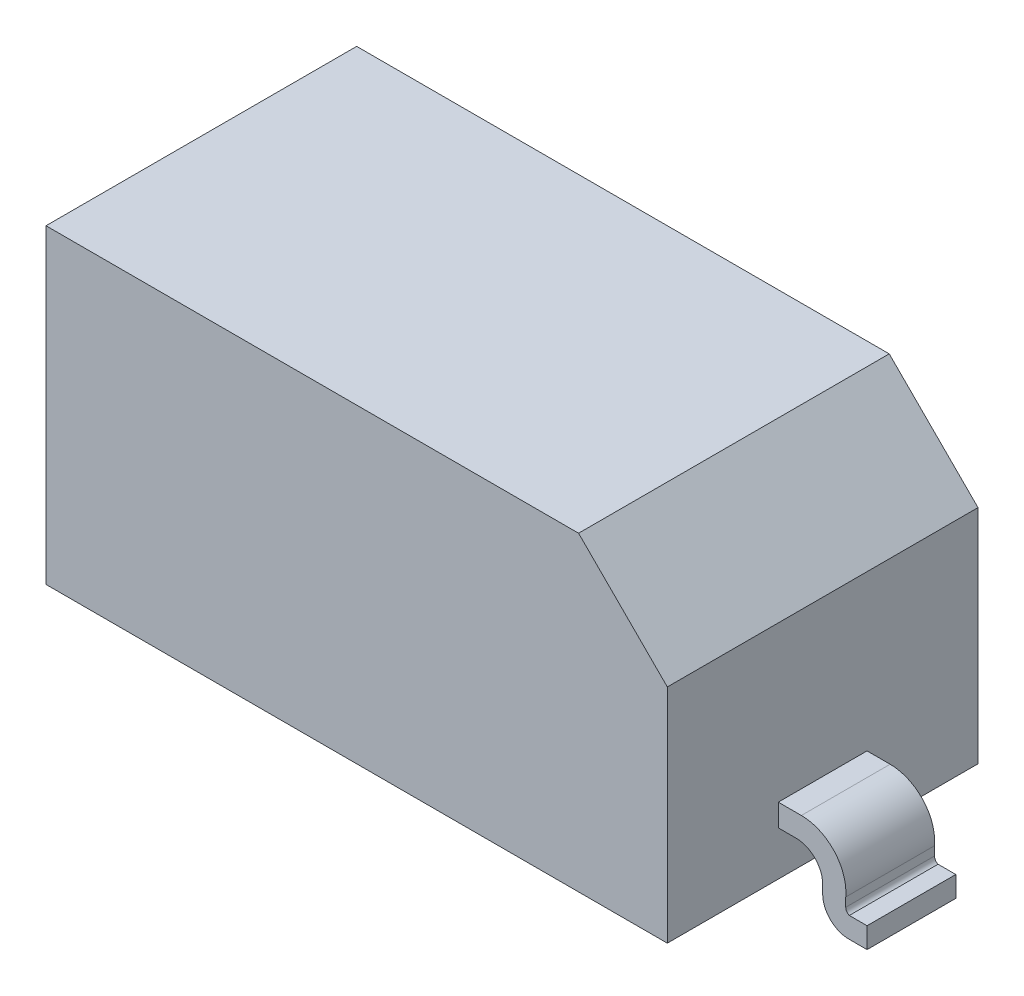
ISO-10303-21;
HEADER;
FILE_DESCRIPTION(('STEP AP214'),'2;1');
FILE_NAME('part.step','',(''),(''),'','','');
FILE_SCHEMA(('AUTOMOTIVE_DESIGN { 1 0 10303 214 1 1 1 1 }'));
ENDSEC;
DATA;
#1=APPLICATION_CONTEXT('core data for automotive mechanical design processes');
#2=APPLICATION_PROTOCOL_DEFINITION('international standard','automotive_design',2000,#1);
#3=PRODUCT_CONTEXT('',#1,'mechanical');
#4=PRODUCT('Part','Part','',(#3));
#5=PRODUCT_RELATED_PRODUCT_CATEGORY('part','',(#4));
#6=PRODUCT_DEFINITION_FORMATION('','',#4);
#7=PRODUCT_DEFINITION_CONTEXT('part definition',#1,'design');
#8=PRODUCT_DEFINITION('design','',#6,#7);
#9=PRODUCT_DEFINITION_SHAPE('','',#8);
#10=(LENGTH_UNIT() NAMED_UNIT(*) SI_UNIT(.MILLI.,.METRE.));
#11=(NAMED_UNIT(*) PLANE_ANGLE_UNIT() SI_UNIT($,.RADIAN.));
#12=(NAMED_UNIT(*) SI_UNIT($,.STERADIAN.) SOLID_ANGLE_UNIT());
#13=UNCERTAINTY_MEASURE_WITH_UNIT(LENGTH_MEASURE(1.E-05),#10,'distance_accuracy_value','');
#14=(GEOMETRIC_REPRESENTATION_CONTEXT(3) GLOBAL_UNCERTAINTY_ASSIGNED_CONTEXT((#13)) GLOBAL_UNIT_ASSIGNED_CONTEXT((#10,
#11,#12)) REPRESENTATION_CONTEXT('',''));
#15=CARTESIAN_POINT('',(0.,0.,0.));
#16=DIRECTION('',(0.,0.,1.));
#17=DIRECTION('',(1.,0.,0.));
#18=AXIS2_PLACEMENT_3D('',#15,#16,#17);
#19=CARTESIAN_POINT('',(54.102,-20.8851131225654,-6.35));
#20=DIRECTION('',(1.,0.,0.));
#21=DIRECTION('',(0.,0.,-1.));
#22=AXIS2_PLACEMENT_3D('',#19,#20,#21);
#23=PLANE('',#22);
#24=DIRECTION('',(0.,1.,0.));
#25=VECTOR('',#24,1.);
#26=CARTESIAN_POINT('',(54.102,-20.8851131225654,6.35));
#27=LINE('',#26,#25);
#28=CARTESIAN_POINT('',(54.102,-19.6151131225653,6.35));
#29=VERTEX_POINT('',#28);
#30=CARTESIAN_POINT('',(54.102,-20.8851131225654,6.35));
#31=VERTEX_POINT('',#30);
#32=EDGE_CURVE('E218',#29,#31,#27,.F.);
#33=ORIENTED_EDGE('',*,*,#32,.T.);
#34=DIRECTION('',(0.,0.,1.));
#35=VECTOR('',#34,1.);
#36=CARTESIAN_POINT('',(54.102,-20.8851131225654,0.));
#37=LINE('',#36,#35);
#38=CARTESIAN_POINT('',(54.102,-20.8851131225654,-6.35));
#39=VERTEX_POINT('',#38);
#40=EDGE_CURVE('E217',#39,#31,#37,.T.);
#41=ORIENTED_EDGE('',*,*,#40,.F.);
#42=DIRECTION('',(0.,1.,0.));
#43=VECTOR('',#42,1.);
#44=CARTESIAN_POINT('',(54.102,-20.8851131225654,-6.35));
#45=LINE('',#44,#43);
#46=CARTESIAN_POINT('',(54.102,-19.6151131225653,-6.35));
#47=VERTEX_POINT('',#46);
#48=EDGE_CURVE('E213',#39,#47,#45,.T.);
#49=ORIENTED_EDGE('',*,*,#48,.T.);
#50=DIRECTION('',(0.,0.,-1.));
#51=VECTOR('',#50,1.);
#52=CARTESIAN_POINT('',(54.102,-19.6151131225654,0.));
#53=LINE('',#52,#51);
#54=EDGE_CURVE('E228',#29,#47,#53,.T.);
#55=ORIENTED_EDGE('',*,*,#54,.F.);
#56=EDGE_LOOP('',(#33,#41,#49,#55));
#57=FACE_BOUND('',#56,.T.);
#58=ADVANCED_FACE('F17',(#57),#23,.T.);
#59=CARTESIAN_POINT('',(54.9275,-20.8851131225654,6.35));
#60=DIRECTION('',(0.,0.,-1.));
#61=DIRECTION('',(-1.,0.,0.));
#62=AXIS2_PLACEMENT_3D('',#59,#60,#61);
#63=CYLINDRICAL_SURFACE('',#62,0.825500000000023);
#64=CARTESIAN_POINT('',(54.9275,-20.8851131225654,6.35));
#65=DIRECTION('',(0.,0.,-1.));
#66=DIRECTION('',(-1.,0.,0.));
#67=AXIS2_PLACEMENT_3D('',#64,#65,#66);
#68=CIRCLE('',#67,0.825500000000023);
#69=CARTESIAN_POINT('',(54.61,-21.6471131225654,6.35));
#70=VERTEX_POINT('',#69);
#71=EDGE_CURVE('E223',#31,#70,#68,.F.);
#72=ORIENTED_EDGE('',*,*,#71,.T.);
#73=DIRECTION('',(0.,0.,1.));
#74=VECTOR('',#73,1.);
#75=CARTESIAN_POINT('',(54.61,-21.6471131225654,6.35));
#76=LINE('',#75,#74);
#77=CARTESIAN_POINT('',(54.6099999999999,-21.6471131225654,-6.35));
#78=VERTEX_POINT('',#77);
#79=EDGE_CURVE('E220',#78,#70,#76,.T.);
#80=ORIENTED_EDGE('',*,*,#79,.F.);
#81=CARTESIAN_POINT('',(54.9275,-20.8851131225655,-6.35));
#82=DIRECTION('',(0.,0.,-1.));
#83=DIRECTION('',(-1.,0.,0.));
#84=AXIS2_PLACEMENT_3D('',#81,#82,#83);
#85=CIRCLE('',#84,0.825500000000023);
#86=EDGE_CURVE('E21',#78,#39,#85,.T.);
#87=ORIENTED_EDGE('',*,*,#86,.T.);
#88=ORIENTED_EDGE('',*,*,#40,.T.);
#89=EDGE_LOOP('',(#72,#80,#87,#88));
#90=FACE_BOUND('',#89,.T.);
#91=ADVANCED_FACE('F221',(#90),#63,.F.);
#92=CARTESIAN_POINT('',(50.8,-20.8780223680016,6.35));
#93=DIRECTION('',(-1.,0.,0.));
#94=DIRECTION('',(0.,0.,1.));
#95=AXIS2_PLACEMENT_3D('',#92,#93,#94);
#96=PLANE('',#95);
#97=DIRECTION('',(0.,1.,0.));
#98=VECTOR('',#97,1.);
#99=CARTESIAN_POINT('',(50.8,-20.8780223680016,6.35));
#100=LINE('',#99,#98);
#101=CARTESIAN_POINT('',(50.8,-20.8780223680016,6.35));
#102=VERTEX_POINT('',#101);
#103=CARTESIAN_POINT('',(50.8,-19.6080223680032,6.35));
#104=VERTEX_POINT('',#103);
#105=EDGE_CURVE('E421',#102,#104,#100,.T.);
#106=ORIENTED_EDGE('',*,*,#105,.T.);
#107=DIRECTION('',(0.,0.,1.));
#108=VECTOR('',#107,1.);
#109=CARTESIAN_POINT('',(50.8,-19.6080223680016,0.));
#110=LINE('',#109,#108);
#111=CARTESIAN_POINT('',(50.8,-19.6080223680031,-6.35));
#112=VERTEX_POINT('',#111);
#113=EDGE_CURVE('E325',#112,#104,#110,.T.);
#114=ORIENTED_EDGE('',*,*,#113,.F.);
#115=DIRECTION('',(0.,1.,0.));
#116=VECTOR('',#115,1.);
#117=CARTESIAN_POINT('',(50.8,-20.8780223680016,-6.35));
#118=LINE('',#117,#116);
#119=CARTESIAN_POINT('',(50.8,-20.8780223680016,-6.35));
#120=VERTEX_POINT('',#119);
#121=EDGE_CURVE('E424',#112,#120,#118,.F.);
#122=ORIENTED_EDGE('',*,*,#121,.T.);
#123=DIRECTION('',(0.,0.,-1.));
#124=VECTOR('',#123,1.);
#125=CARTESIAN_POINT('',(50.8,-20.8780223680016,0.));
#126=LINE('',#125,#124);
#127=EDGE_CURVE('E381',#102,#120,#126,.T.);
#128=ORIENTED_EDGE('',*,*,#127,.F.);
#129=EDGE_LOOP('',(#106,#114,#122,#128));
#130=FACE_BOUND('',#129,.T.);
#131=ADVANCED_FACE('F503',(#130),#96,.T.);
#132=CARTESIAN_POINT('',(-50.8,-20.8780223680016,6.35));
#133=DIRECTION('',(1.,0.,0.));
#134=DIRECTION('',(0.,0.,-1.));
#135=AXIS2_PLACEMENT_3D('',#132,#133,#134);
#136=PLANE('',#135);
#137=DIRECTION('',(0.,1.,0.));
#138=VECTOR('',#137,1.);
#139=CARTESIAN_POINT('',(-50.8,-20.8780223680016,6.35));
#140=LINE('',#139,#138);
#141=CARTESIAN_POINT('',(-50.8,-19.6080223680032,6.35));
#142=VERTEX_POINT('',#141);
#143=CARTESIAN_POINT('',(-50.8,-20.8780223680016,6.35));
#144=VERTEX_POINT('',#143);
#145=EDGE_CURVE('E420',#142,#144,#140,.F.);
#146=ORIENTED_EDGE('',*,*,#145,.T.);
#147=DIRECTION('',(0.,0.,1.));
#148=VECTOR('',#147,1.);
#149=CARTESIAN_POINT('',(-50.8,-20.8780223680016,0.));
#150=LINE('',#149,#148);
#151=CARTESIAN_POINT('',(-50.8,-20.8780223680016,-6.35));
#152=VERTEX_POINT('',#151);
#153=EDGE_CURVE('E319',#152,#144,#150,.T.);
#154=ORIENTED_EDGE('',*,*,#153,.F.);
#155=DIRECTION('',(0.,1.,0.));
#156=VECTOR('',#155,1.);
#157=CARTESIAN_POINT('',(-50.8,-20.8780223680016,-6.35));
#158=LINE('',#157,#156);
#159=CARTESIAN_POINT('',(-50.8,-19.6080223680031,-6.35));
#160=VERTEX_POINT('',#159);
#161=EDGE_CURVE('E418',#152,#160,#158,.T.);
#162=ORIENTED_EDGE('',*,*,#161,.T.);
#163=DIRECTION('',(0.,0.,-1.));
#164=VECTOR('',#163,1.);
#165=CARTESIAN_POINT('',(-50.8,-19.6080223680016,0.));
#166=LINE('',#165,#164);
#167=EDGE_CURVE('E322',#142,#160,#166,.T.);
#168=ORIENTED_EDGE('',*,*,#167,.F.);
#169=EDGE_LOOP('',(#146,#154,#162,#168));
#170=FACE_BOUND('',#169,.T.);
#171=ADVANCED_FACE('F616',(#170),#136,.T.);
#172=CARTESIAN_POINT('',(-54.9275,-20.8851131225654,6.35));
#173=DIRECTION('',(0.,0.,-1.));
#174=DIRECTION('',(-1.,0.,0.));
#175=AXIS2_PLACEMENT_3D('',#172,#173,#174);
#176=CYLINDRICAL_SURFACE('',#175,0.825500000000023);
#177=CARTESIAN_POINT('',(-54.9275,-20.8851131225654,6.35));
#178=DIRECTION('',(0.,0.,-1.));
#179=DIRECTION('',(-1.,0.,0.));
#180=AXIS2_PLACEMENT_3D('',#177,#178,#179);
#181=CIRCLE('',#180,0.825500000000023);
#182=CARTESIAN_POINT('',(-54.61,-21.6471131225654,6.35));
#183=VERTEX_POINT('',#182);
#184=CARTESIAN_POINT('',(-54.102,-20.8851131225654,6.35));
#185=VERTEX_POINT('',#184);
#186=EDGE_CURVE('E416',#183,#185,#181,.F.);
#187=ORIENTED_EDGE('',*,*,#186,.T.);
#188=DIRECTION('',(0.,0.,1.));
#189=VECTOR('',#188,1.);
#190=CARTESIAN_POINT('',(-54.102,-20.8851131225654,-6.35));
#191=LINE('',#190,#189);
#192=CARTESIAN_POINT('',(-54.102,-20.8851131225654,-6.35));
#193=VERTEX_POINT('',#192);
#194=EDGE_CURVE('E415',#193,#185,#191,.T.);
#195=ORIENTED_EDGE('',*,*,#194,.F.);
#196=CARTESIAN_POINT('',(-54.9275,-20.8851131225655,-6.35));
#197=DIRECTION('',(0.,0.,-1.));
#198=DIRECTION('',(-1.,0.,0.));
#199=AXIS2_PLACEMENT_3D('',#196,#197,#198);
#200=CIRCLE('',#199,0.825500000000023);
#201=CARTESIAN_POINT('',(-54.6099999999999,-21.6471131225654,-6.35));
#202=VERTEX_POINT('',#201);
#203=EDGE_CURVE('E423',#193,#202,#200,.T.);
#204=ORIENTED_EDGE('',*,*,#203,.T.);
#205=DIRECTION('',(0.,0.,1.));
#206=VECTOR('',#205,1.);
#207=CARTESIAN_POINT('',(-54.61,-21.6471131225654,-6.35));
#208=LINE('',#207,#206);
#209=EDGE_CURVE('E299',#183,#202,#208,.F.);
#210=ORIENTED_EDGE('',*,*,#209,.F.);
#211=EDGE_LOOP('',(#187,#195,#204,#210));
#212=FACE_BOUND('',#211,.T.);
#213=ADVANCED_FACE('F459',(#212),#176,.F.);
#214=CARTESIAN_POINT('',(-54.102,-20.8851131225654,-6.35));
#215=DIRECTION('',(-1.,0.,0.));
#216=DIRECTION('',(0.,0.,1.));
#217=AXIS2_PLACEMENT_3D('',#214,#215,#216);
#218=PLANE('',#217);
#219=DIRECTION('',(0.,1.,0.));
#220=VECTOR('',#219,1.);
#221=CARTESIAN_POINT('',(-54.102,-20.8851131225654,6.35));
#222=LINE('',#221,#220);
#223=CARTESIAN_POINT('',(-54.102,-19.6151131225654,6.35));
#224=VERTEX_POINT('',#223);
#225=EDGE_CURVE('E397',#185,#224,#222,.T.);
#226=ORIENTED_EDGE('',*,*,#225,.T.);
#227=DIRECTION('',(0.,0.,1.));
#228=VECTOR('',#227,1.);
#229=CARTESIAN_POINT('',(-54.102,-19.6151131225654,0.));
#230=LINE('',#229,#228);
#231=CARTESIAN_POINT('',(-54.102,-19.6151131225653,-6.35));
#232=VERTEX_POINT('',#231);
#233=EDGE_CURVE('E295',#232,#224,#230,.T.);
#234=ORIENTED_EDGE('',*,*,#233,.F.);
#235=DIRECTION('',(0.,1.,0.));
#236=VECTOR('',#235,1.);
#237=CARTESIAN_POINT('',(-54.102,-20.8851131225654,-6.35));
#238=LINE('',#237,#236);
#239=EDGE_CURVE('E412',#232,#193,#238,.F.);
#240=ORIENTED_EDGE('',*,*,#239,.T.);
#241=ORIENTED_EDGE('',*,*,#194,.T.);
#242=EDGE_LOOP('',(#226,#234,#240,#241));
#243=FACE_BOUND('',#242,.T.);
#244=ADVANCED_FACE('F629',(#243),#218,.T.);
#245=CARTESIAN_POINT('',(47.752,-19.061043660236,6.35));
#246=DIRECTION('',(0.,0.,-1.));
#247=DIRECTION('',(-1.,0.,0.));
#248=AXIS2_PLACEMENT_3D('',#245,#246,#247);
#249=CYLINDRICAL_SURFACE('',#248,6.37412683973937);
#250=CARTESIAN_POINT('',(47.752,-19.061043660236,6.35));
#251=DIRECTION('',(0.,0.,-1.));
#252=DIRECTION('',(-1.,0.,0.));
#253=AXIS2_PLACEMENT_3D('',#250,#251,#252);
#254=CIRCLE('',#253,6.37412683973937);
#255=CARTESIAN_POINT('',(47.752,-12.6869168204966,6.35));
#256=VERTEX_POINT('',#255);
#257=EDGE_CURVE('E252',#29,#256,#254,.F.);
#258=ORIENTED_EDGE('',*,*,#257,.F.);
#259=ORIENTED_EDGE('',*,*,#54,.T.);
#260=CARTESIAN_POINT('',(47.752,-19.061043660236,-6.35));
#261=DIRECTION('',(0.,0.,-1.));
#262=DIRECTION('',(-1.,0.,0.));
#263=AXIS2_PLACEMENT_3D('',#260,#261,#262);
#264=CIRCLE('',#263,6.37412683973937);
#265=CARTESIAN_POINT('',(47.752,-12.6869168204966,-6.35));
#266=VERTEX_POINT('',#265);
#267=EDGE_CURVE('E233',#266,#47,#264,.T.);
#268=ORIENTED_EDGE('',*,*,#267,.F.);
#269=DIRECTION('',(0.,0.,1.));
#270=VECTOR('',#269,1.);
#271=CARTESIAN_POINT('',(47.752,-12.6869168204966,6.35));
#272=LINE('',#271,#270);
#273=EDGE_CURVE('E247',#256,#266,#272,.F.);
#274=ORIENTED_EDGE('',*,*,#273,.F.);
#275=EDGE_LOOP('',(#258,#259,#268,#274));
#276=FACE_BOUND('',#275,.T.);
#277=ADVANCED_FACE('F524',(#276),#249,.T.);
#278=CARTESIAN_POINT('',(54.61,-21.6471131225654,6.35));
#279=DIRECTION('',(0.,1.,0.));
#280=DIRECTION('',(0.,0.,1.));
#281=AXIS2_PLACEMENT_3D('',#278,#279,#280);
#282=PLANE('',#281);
#283=DIRECTION('',(1.,0.,0.));
#284=VECTOR('',#283,1.);
#285=CARTESIAN_POINT('',(57.15,-21.6471131225654,6.35));
#286=LINE('',#285,#284);
#287=CARTESIAN_POINT('',(57.15,-21.6471131225654,6.35));
#288=VERTEX_POINT('',#287);
#289=EDGE_CURVE('E250',#288,#70,#286,.F.);
#290=ORIENTED_EDGE('',*,*,#289,.F.);
#291=DIRECTION('',(0.,0.,-1.));
#292=VECTOR('',#291,1.);
#293=CARTESIAN_POINT('',(57.15,-21.6471131225654,-6.35));
#294=LINE('',#293,#292);
#295=CARTESIAN_POINT('',(57.15,-21.6471131225654,-6.35));
#296=VERTEX_POINT('',#295);
#297=EDGE_CURVE('E227',#296,#288,#294,.F.);
#298=ORIENTED_EDGE('',*,*,#297,.F.);
#299=DIRECTION('',(-1.,0.,0.));
#300=VECTOR('',#299,1.);
#301=CARTESIAN_POINT('',(57.15,-21.6471131225654,-6.35));
#302=LINE('',#301,#300);
#303=EDGE_CURVE('E211',#78,#296,#302,.F.);
#304=ORIENTED_EDGE('',*,*,#303,.F.);
#305=ORIENTED_EDGE('',*,*,#79,.T.);
#306=EDGE_LOOP('',(#290,#298,#304,#305));
#307=FACE_BOUND('',#306,.T.);
#308=ADVANCED_FACE('F230',(#307),#282,.T.);
#309=CARTESIAN_POINT('',(57.15,-24.6110447360031,-6.35));
#310=DIRECTION('',(1.,0.,0.));
#311=DIRECTION('',(0.,0.,-1.));
#312=AXIS2_PLACEMENT_3D('',#309,#310,#311);
#313=PLANE('',#312);
#314=DIRECTION('',(0.,1.,0.));
#315=VECTOR('',#314,1.);
#316=CARTESIAN_POINT('',(57.15,-24.7311156921919,6.35));
#317=LINE('',#316,#315);
#318=CARTESIAN_POINT('',(57.15,-24.6110447360031,6.35));
#319=VERTEX_POINT('',#318);
#320=EDGE_CURVE('E253',#319,#288,#317,.T.);
#321=ORIENTED_EDGE('',*,*,#320,.F.);
#322=DIRECTION('',(0.,0.,-1.));
#323=VECTOR('',#322,1.);
#324=CARTESIAN_POINT('',(57.15,-24.6110447360031,-6.35));
#325=LINE('',#324,#323);
#326=CARTESIAN_POINT('',(57.15,-24.6110447360031,-6.35));
#327=VERTEX_POINT('',#326);
#328=EDGE_CURVE('E386',#327,#319,#325,.F.);
#329=ORIENTED_EDGE('',*,*,#328,.F.);
#330=DIRECTION('',(0.,1.,0.));
#331=VECTOR('',#330,1.);
#332=CARTESIAN_POINT('',(57.15,-24.7311156921919,-6.35));
#333=LINE('',#332,#331);
#334=EDGE_CURVE('E232',#296,#327,#333,.F.);
#335=ORIENTED_EDGE('',*,*,#334,.F.);
#336=ORIENTED_EDGE('',*,*,#297,.T.);
#337=EDGE_LOOP('',(#321,#329,#335,#336));
#338=FACE_BOUND('',#337,.T.);
#339=ADVANCED_FACE('F530',(#338),#313,.T.);
#340=CARTESIAN_POINT('',(54.61,-24.6110447360031,-6.35));
#341=DIRECTION('',(0.,-1.,0.));
#342=DIRECTION('',(0.,0.,-1.));
#343=AXIS2_PLACEMENT_3D('',#340,#341,#342);
#344=PLANE('',#343);
#345=DIRECTION('',(1.,0.,0.));
#346=VECTOR('',#345,1.);
#347=CARTESIAN_POINT('',(57.15,-24.6110447360031,6.35));
#348=LINE('',#347,#346);
#349=CARTESIAN_POINT('',(54.61,-24.6110447360031,6.35));
#350=VERTEX_POINT('',#349);
#351=EDGE_CURVE('E256',#350,#319,#348,.T.);
#352=ORIENTED_EDGE('',*,*,#351,.F.);
#353=DIRECTION('',(0.,0.,1.));
#354=VECTOR('',#353,1.);
#355=CARTESIAN_POINT('',(54.61,-24.6110447360031,0.));
#356=LINE('',#355,#354);
#357=CARTESIAN_POINT('',(54.6100000000001,-24.6110447360031,-6.35));
#358=VERTEX_POINT('',#357);
#359=EDGE_CURVE('E384',#358,#350,#356,.T.);
#360=ORIENTED_EDGE('',*,*,#359,.F.);
#361=DIRECTION('',(-1.,0.,0.));
#362=VECTOR('',#361,1.);
#363=CARTESIAN_POINT('',(57.15,-24.6110447360031,-6.35));
#364=LINE('',#363,#362);
#365=EDGE_CURVE('E235',#327,#358,#364,.T.);
#366=ORIENTED_EDGE('',*,*,#365,.F.);
#367=ORIENTED_EDGE('',*,*,#328,.T.);
#368=EDGE_LOOP('',(#352,#360,#366,#367));
#369=FACE_BOUND('',#368,.T.);
#370=ADVANCED_FACE('F496',(#369),#344,.T.);
#371=CARTESIAN_POINT('',(54.5338,-20.8780223680016,6.35));
#372=DIRECTION('',(0.,0.,-1.));
#373=DIRECTION('',(0.,1.,0.));
#374=AXIS2_PLACEMENT_3D('',#371,#372,#373);
#375=CYLINDRICAL_SURFACE('',#374,3.7338);
#376=CARTESIAN_POINT('',(54.5338,-20.8780223680016,6.35));
#377=DIRECTION('',(0.,0.,-1.));
#378=DIRECTION('',(0.,1.,0.));
#379=AXIS2_PLACEMENT_3D('',#376,#377,#378);
#380=CIRCLE('',#379,3.7338);
#381=EDGE_CURVE('E259',#102,#350,#380,.F.);
#382=ORIENTED_EDGE('',*,*,#381,.F.);
#383=ORIENTED_EDGE('',*,*,#127,.T.);
#384=CARTESIAN_POINT('',(54.5338,-20.8780223680016,-6.35));
#385=DIRECTION('',(0.,0.,-1.));
#386=DIRECTION('',(0.,1.,0.));
#387=AXIS2_PLACEMENT_3D('',#384,#385,#386);
#388=CIRCLE('',#387,3.7338);
#389=EDGE_CURVE('E447',#358,#120,#388,.T.);
#390=ORIENTED_EDGE('',*,*,#389,.F.);
#391=ORIENTED_EDGE('',*,*,#359,.T.);
#392=EDGE_LOOP('',(#382,#383,#390,#391));
#393=FACE_BOUND('',#392,.T.);
#394=ADVANCED_FACE('F500',(#393),#375,.T.);
#395=CARTESIAN_POINT('',(46.99,-19.6857936673348,6.35));
#396=DIRECTION('',(0.,0.,-1.));
#397=DIRECTION('',(0.,1.,0.));
#398=AXIS2_PLACEMENT_3D('',#395,#396,#397);
#399=CYLINDRICAL_SURFACE('',#398,3.81079366733487);
#400=CARTESIAN_POINT('',(46.99,-19.6857936673348,6.35));
#401=DIRECTION('',(0.,0.,-1.));
#402=DIRECTION('',(0.,1.,0.));
#403=AXIS2_PLACEMENT_3D('',#400,#401,#402);
#404=CIRCLE('',#403,3.81079366733487);
#405=CARTESIAN_POINT('',(46.99,-15.875,6.35));
#406=VERTEX_POINT('',#405);
#407=EDGE_CURVE('E298',#406,#104,#404,.T.);
#408=ORIENTED_EDGE('',*,*,#407,.F.);
#409=DIRECTION('',(0.,0.,-1.));
#410=VECTOR('',#409,1.);
#411=CARTESIAN_POINT('',(46.99,-15.875,-6.35));
#412=LINE('',#411,#410);
#413=CARTESIAN_POINT('',(46.99,-15.875,-6.35));
#414=VERTEX_POINT('',#413);
#415=EDGE_CURVE('E346',#414,#406,#412,.F.);
#416=ORIENTED_EDGE('',*,*,#415,.F.);
#417=CARTESIAN_POINT('',(46.99,-19.6857936673348,-6.35));
#418=DIRECTION('',(0.,0.,-1.));
#419=DIRECTION('',(0.,1.,0.));
#420=AXIS2_PLACEMENT_3D('',#417,#418,#419);
#421=CIRCLE('',#420,3.81079366733487);
#422=EDGE_CURVE('E372',#112,#414,#421,.F.);
#423=ORIENTED_EDGE('',*,*,#422,.F.);
#424=ORIENTED_EDGE('',*,*,#113,.T.);
#425=EDGE_LOOP('',(#408,#416,#423,#424));
#426=FACE_BOUND('',#425,.T.);
#427=ADVANCED_FACE('F510',(#426),#399,.F.);
#428=CARTESIAN_POINT('',(-46.99,-19.6857936673348,6.35));
#429=DIRECTION('',(0.,0.,-1.));
#430=DIRECTION('',(0.,1.,0.));
#431=AXIS2_PLACEMENT_3D('',#428,#429,#430);
#432=CYLINDRICAL_SURFACE('',#431,3.81079366733487);
#433=CARTESIAN_POINT('',(-46.99,-19.6857936673348,6.35));
#434=DIRECTION('',(0.,0.,-1.));
#435=DIRECTION('',(0.,1.,0.));
#436=AXIS2_PLACEMENT_3D('',#433,#434,#435);
#437=CIRCLE('',#436,3.81079366733487);
#438=CARTESIAN_POINT('',(-46.99,-15.875,6.35));
#439=VERTEX_POINT('',#438);
#440=EDGE_CURVE('E336',#142,#439,#437,.T.);
#441=ORIENTED_EDGE('',*,*,#440,.F.);
#442=ORIENTED_EDGE('',*,*,#167,.T.);
#443=CARTESIAN_POINT('',(-46.99,-19.6857936673348,-6.35));
#444=DIRECTION('',(0.,0.,-1.));
#445=DIRECTION('',(0.,1.,0.));
#446=AXIS2_PLACEMENT_3D('',#443,#444,#445);
#447=CIRCLE('',#446,3.81079366733487);
#448=CARTESIAN_POINT('',(-46.99,-15.875,-6.35));
#449=VERTEX_POINT('',#448);
#450=EDGE_CURVE('E436',#449,#160,#447,.F.);
#451=ORIENTED_EDGE('',*,*,#450,.F.);
#452=DIRECTION('',(0.,0.,-1.));
#453=VECTOR('',#452,1.);
#454=CARTESIAN_POINT('',(-46.99,-15.875,6.35));
#455=LINE('',#454,#453);
#456=EDGE_CURVE('E326',#439,#449,#455,.T.);
#457=ORIENTED_EDGE('',*,*,#456,.F.);
#458=EDGE_LOOP('',(#441,#442,#451,#457));
#459=FACE_BOUND('',#458,.T.);
#460=ADVANCED_FACE('F604',(#459),#432,.F.);
#461=CARTESIAN_POINT('',(-54.5338,-20.8780223680016,6.35));
#462=DIRECTION('',(0.,0.,-1.));
#463=DIRECTION('',(0.,1.,0.));
#464=AXIS2_PLACEMENT_3D('',#461,#462,#463);
#465=CYLINDRICAL_SURFACE('',#464,3.7338);
#466=CARTESIAN_POINT('',(-54.5338,-20.8780223680016,6.35));
#467=DIRECTION('',(0.,0.,-1.));
#468=DIRECTION('',(0.,1.,0.));
#469=AXIS2_PLACEMENT_3D('',#466,#467,#468);
#470=CIRCLE('',#469,3.7338);
#471=CARTESIAN_POINT('',(-54.61,-24.6110447360031,6.35));
#472=VERTEX_POINT('',#471);
#473=EDGE_CURVE('E440',#472,#144,#470,.F.);
#474=ORIENTED_EDGE('',*,*,#473,.F.);
#475=DIRECTION('',(0.,0.,-1.));
#476=VECTOR('',#475,1.);
#477=CARTESIAN_POINT('',(-54.61,-24.6110447360031,6.35));
#478=LINE('',#477,#476);
#479=CARTESIAN_POINT('',(-54.6100000000001,-24.6110447360031,-6.35));
#480=VERTEX_POINT('',#479);
#481=EDGE_CURVE('E315',#480,#472,#478,.F.);
#482=ORIENTED_EDGE('',*,*,#481,.F.);
#483=CARTESIAN_POINT('',(-54.5338,-20.8780223680016,-6.35));
#484=DIRECTION('',(0.,0.,-1.));
#485=DIRECTION('',(0.,1.,0.));
#486=AXIS2_PLACEMENT_3D('',#483,#484,#485);
#487=CIRCLE('',#486,3.7338);
#488=EDGE_CURVE('E433',#152,#480,#487,.T.);
#489=ORIENTED_EDGE('',*,*,#488,.F.);
#490=ORIENTED_EDGE('',*,*,#153,.T.);
#491=EDGE_LOOP('',(#474,#482,#489,#490));
#492=FACE_BOUND('',#491,.T.);
#493=ADVANCED_FACE('F599',(#492),#465,.T.);
#494=CARTESIAN_POINT('',(-57.15,-24.6110447360031,6.35));
#495=DIRECTION('',(0.,-1.,0.));
#496=DIRECTION('',(0.,0.,-1.));
#497=AXIS2_PLACEMENT_3D('',#494,#495,#496);
#498=PLANE('',#497);
#499=DIRECTION('',(1.,0.,0.));
#500=VECTOR('',#499,1.);
#501=CARTESIAN_POINT('',(-57.15,-24.6110447360031,6.35));
#502=LINE('',#501,#500);
#503=CARTESIAN_POINT('',(-57.15,-24.6110447360031,6.35));
#504=VERTEX_POINT('',#503);
#505=EDGE_CURVE('E342',#504,#472,#502,.T.);
#506=ORIENTED_EDGE('',*,*,#505,.F.);
#507=DIRECTION('',(0.,0.,1.));
#508=VECTOR('',#507,1.);
#509=CARTESIAN_POINT('',(-57.15,-24.6110447360031,-6.35));
#510=LINE('',#509,#508);
#511=CARTESIAN_POINT('',(-57.15,-24.6110447360031,-6.35));
#512=VERTEX_POINT('',#511);
#513=EDGE_CURVE('E304',#512,#504,#510,.T.);
#514=ORIENTED_EDGE('',*,*,#513,.F.);
#515=DIRECTION('',(-1.,0.,0.));
#516=VECTOR('',#515,1.);
#517=CARTESIAN_POINT('',(-57.15,-24.6110447360031,-6.35));
#518=LINE('',#517,#516);
#519=EDGE_CURVE('E311',#480,#512,#518,.T.);
#520=ORIENTED_EDGE('',*,*,#519,.F.);
#521=ORIENTED_EDGE('',*,*,#481,.T.);
#522=EDGE_LOOP('',(#506,#514,#520,#521));
#523=FACE_BOUND('',#522,.T.);
#524=ADVANCED_FACE('F596',(#523),#498,.T.);
#525=CARTESIAN_POINT('',(-57.15,-24.6110447360031,-6.35));
#526=DIRECTION('',(-1.,0.,0.));
#527=DIRECTION('',(0.,0.,1.));
#528=AXIS2_PLACEMENT_3D('',#525,#526,#527);
#529=PLANE('',#528);
#530=DIRECTION('',(0.,1.,0.));
#531=VECTOR('',#530,1.);
#532=CARTESIAN_POINT('',(-57.15,-12.6869168204966,6.35));
#533=LINE('',#532,#531);
#534=CARTESIAN_POINT('',(-57.15,-21.6471131225654,6.35));
#535=VERTEX_POINT('',#534);
#536=EDGE_CURVE('E339',#535,#504,#533,.F.);
#537=ORIENTED_EDGE('',*,*,#536,.F.);
#538=DIRECTION('',(0.,0.,1.));
#539=VECTOR('',#538,1.);
#540=CARTESIAN_POINT('',(-57.15,-21.6471131225654,-6.35));
#541=LINE('',#540,#539);
#542=CARTESIAN_POINT('',(-57.15,-21.6471131225654,-6.35));
#543=VERTEX_POINT('',#542);
#544=EDGE_CURVE('E302',#543,#535,#541,.T.);
#545=ORIENTED_EDGE('',*,*,#544,.F.);
#546=DIRECTION('',(0.,1.,0.));
#547=VECTOR('',#546,1.);
#548=CARTESIAN_POINT('',(-57.15,-12.6869168204966,-6.35));
#549=LINE('',#548,#547);
#550=EDGE_CURVE('E307',#512,#543,#549,.T.);
#551=ORIENTED_EDGE('',*,*,#550,.F.);
#552=ORIENTED_EDGE('',*,*,#513,.T.);
#553=EDGE_LOOP('',(#537,#545,#551,#552));
#554=FACE_BOUND('',#553,.T.);
#555=ADVANCED_FACE('F593',(#554),#529,.T.);
#556=CARTESIAN_POINT('',(-57.15,-21.6471131225654,-6.35));
#557=DIRECTION('',(0.,1.,0.));
#558=DIRECTION('',(0.,0.,1.));
#559=AXIS2_PLACEMENT_3D('',#556,#557,#558);
#560=PLANE('',#559);
#561=DIRECTION('',(1.,0.,0.));
#562=VECTOR('',#561,1.);
#563=CARTESIAN_POINT('',(-57.15,-21.6471131225654,6.35));
#564=LINE('',#563,#562);
#565=EDGE_CURVE('E343',#183,#535,#564,.F.);
#566=ORIENTED_EDGE('',*,*,#565,.F.);
#567=ORIENTED_EDGE('',*,*,#209,.T.);
#568=DIRECTION('',(-1.,0.,0.));
#569=VECTOR('',#568,1.);
#570=CARTESIAN_POINT('',(-57.15,-21.6471131225654,-6.35));
#571=LINE('',#570,#569);
#572=EDGE_CURVE('E310',#543,#202,#571,.F.);
#573=ORIENTED_EDGE('',*,*,#572,.F.);
#574=ORIENTED_EDGE('',*,*,#544,.T.);
#575=EDGE_LOOP('',(#566,#567,#573,#574));
#576=FACE_BOUND('',#575,.T.);
#577=ADVANCED_FACE('F466',(#576),#560,.T.);
#578=CARTESIAN_POINT('',(-47.752,-19.061043660236,6.35000000000001));
#579=DIRECTION('',(0.,0.,-1.));
#580=DIRECTION('',(0.,1.,0.));
#581=AXIS2_PLACEMENT_3D('',#578,#579,#580);
#582=CYLINDRICAL_SURFACE('',#581,6.37412683973939);
#583=DIRECTION('',(0.,0.,1.));
#584=VECTOR('',#583,1.);
#585=CARTESIAN_POINT('',(-47.752,-12.6869168204966,-6.35));
#586=LINE('',#585,#584);
#587=CARTESIAN_POINT('',(-47.752,-12.6869168204966,-6.35));
#588=VERTEX_POINT('',#587);
#589=CARTESIAN_POINT('',(-47.752,-12.6869168204966,6.35));
#590=VERTEX_POINT('',#589);
#591=EDGE_CURVE('E262',#588,#590,#586,.T.);
#592=ORIENTED_EDGE('',*,*,#591,.F.);
#593=CARTESIAN_POINT('',(-47.752,-19.061043660236,-6.34999999999999));
#594=DIRECTION('',(0.,0.,-1.));
#595=DIRECTION('',(0.,1.,0.));
#596=AXIS2_PLACEMENT_3D('',#593,#594,#595);
#597=CIRCLE('',#596,6.37412683973939);
#598=EDGE_CURVE('E288',#232,#588,#597,.T.);
#599=ORIENTED_EDGE('',*,*,#598,.F.);
#600=ORIENTED_EDGE('',*,*,#233,.T.);
#601=CARTESIAN_POINT('',(-47.7520000000002,-19.0610436602359,6.35000000000001));
#602=DIRECTION('',(0.,0.,-1.));
#603=DIRECTION('',(-1.,0.,0.));
#604=AXIS2_PLACEMENT_3D('',#601,#602,#603);
#605=CIRCLE('',#604,6.3741268397392);
#606=EDGE_CURVE('E443',#590,#224,#605,.F.);
#607=ORIENTED_EDGE('',*,*,#606,.F.);
#608=EDGE_LOOP('',(#592,#599,#600,#607));
#609=FACE_BOUND('',#608,.T.);
#610=ADVANCED_FACE('F19',(#609),#582,.T.);
#611=CARTESIAN_POINT('',(57.15,-24.7311156921919,6.35));
#612=DIRECTION('',(0.,0.,1.));
#613=DIRECTION('',(1.,0.,0.));
#614=AXIS2_PLACEMENT_3D('',#611,#612,#613);
#615=PLANE('',#614);
#616=ORIENTED_EDGE('',*,*,#257,.T.);
#617=DIRECTION('',(1.,0.,0.));
#618=VECTOR('',#617,1.);
#619=CARTESIAN_POINT('',(44.45,-12.6869168204966,6.35));
#620=LINE('',#619,#618);
#621=CARTESIAN_POINT('',(44.45,-12.6869168204966,6.35));
#622=VERTEX_POINT('',#621);
#623=EDGE_CURVE('E399',#622,#256,#620,.T.);
#624=ORIENTED_EDGE('',*,*,#623,.F.);
#625=DIRECTION('',(0.,1.,0.));
#626=VECTOR('',#625,1.);
#627=CARTESIAN_POINT('',(44.45,9.52500000000003,6.35));
#628=LINE('',#627,#626);
#629=CARTESIAN_POINT('',(44.45,-15.875,6.35));
#630=VERTEX_POINT('',#629);
#631=EDGE_CURVE('E356',#630,#622,#628,.T.);
#632=ORIENTED_EDGE('',*,*,#631,.F.);
#633=DIRECTION('',(1.,0.,0.));
#634=VECTOR('',#633,1.);
#635=CARTESIAN_POINT('',(44.45,-15.875,6.35));
#636=LINE('',#635,#634);
#637=EDGE_CURVE('E349',#406,#630,#636,.F.);
#638=ORIENTED_EDGE('',*,*,#637,.F.);
#639=ORIENTED_EDGE('',*,*,#407,.T.);
#640=ORIENTED_EDGE('',*,*,#105,.F.);
#641=ORIENTED_EDGE('',*,*,#381,.T.);
#642=ORIENTED_EDGE('',*,*,#351,.T.);
#643=ORIENTED_EDGE('',*,*,#320,.T.);
#644=ORIENTED_EDGE('',*,*,#289,.T.);
#645=ORIENTED_EDGE('',*,*,#71,.F.);
#646=ORIENTED_EDGE('',*,*,#32,.F.);
#647=EDGE_LOOP('',(#616,#624,#632,#638,#639,#640,#641,#642,#643,#644,#645,#646));
#648=FACE_BOUND('',#647,.T.);
#649=ADVANCED_FACE('F528',(#648),#615,.T.);
#650=CARTESIAN_POINT('',(44.45,-12.6869168204966,6.35));
#651=DIRECTION('',(0.,1.,0.));
#652=DIRECTION('',(0.,0.,1.));
#653=AXIS2_PLACEMENT_3D('',#650,#651,#652);
#654=PLANE('',#653);
#655=ORIENTED_EDGE('',*,*,#623,.T.);
#656=ORIENTED_EDGE('',*,*,#273,.T.);
#657=DIRECTION('',(-1.,0.,0.));
#658=VECTOR('',#657,1.);
#659=CARTESIAN_POINT('',(57.15,-12.6869168204966,-6.35));
#660=LINE('',#659,#658);
#661=CARTESIAN_POINT('',(44.45,-12.6869168204966,-6.35));
#662=VERTEX_POINT('',#661);
#663=EDGE_CURVE('E237',#662,#266,#660,.F.);
#664=ORIENTED_EDGE('',*,*,#663,.F.);
#665=DIRECTION('',(0.,0.,-1.));
#666=VECTOR('',#665,1.);
#667=CARTESIAN_POINT('',(44.45,-12.6869168204966,-22.225));
#668=LINE('',#667,#666);
#669=EDGE_CURVE('E359',#622,#662,#668,.T.);
#670=ORIENTED_EDGE('',*,*,#669,.F.);
#671=EDGE_LOOP('',(#655,#656,#664,#670));
#672=FACE_BOUND('',#671,.T.);
#673=ADVANCED_FACE('F520',(#672),#654,.T.);
#674=CARTESIAN_POINT('',(57.15,-24.7311156921919,-6.35));
#675=DIRECTION('',(0.,0.,-1.));
#676=DIRECTION('',(-1.,0.,0.));
#677=AXIS2_PLACEMENT_3D('',#674,#675,#676);
#678=PLANE('',#677);
#679=ORIENTED_EDGE('',*,*,#422,.T.);
#680=DIRECTION('',(1.,0.,0.));
#681=VECTOR('',#680,1.);
#682=CARTESIAN_POINT('',(44.45,-15.875,-6.35));
#683=LINE('',#682,#681);
#684=CARTESIAN_POINT('',(44.45,-15.875,-6.35));
#685=VERTEX_POINT('',#684);
#686=EDGE_CURVE('E350',#685,#414,#683,.T.);
#687=ORIENTED_EDGE('',*,*,#686,.F.);
#688=DIRECTION('',(0.,1.,0.));
#689=VECTOR('',#688,1.);
#690=CARTESIAN_POINT('',(44.45,9.52500000000003,-6.35));
#691=LINE('',#690,#689);
#692=EDGE_CURVE('E367',#662,#685,#691,.F.);
#693=ORIENTED_EDGE('',*,*,#692,.F.);
#694=ORIENTED_EDGE('',*,*,#663,.T.);
#695=ORIENTED_EDGE('',*,*,#267,.T.);
#696=ORIENTED_EDGE('',*,*,#48,.F.);
#697=ORIENTED_EDGE('',*,*,#86,.F.);
#698=ORIENTED_EDGE('',*,*,#303,.T.);
#699=ORIENTED_EDGE('',*,*,#334,.T.);
#700=ORIENTED_EDGE('',*,*,#365,.T.);
#701=ORIENTED_EDGE('',*,*,#389,.T.);
#702=ORIENTED_EDGE('',*,*,#121,.F.);
#703=EDGE_LOOP('',(#679,#687,#693,#694,#695,#696,#697,#698,#699,#700,#701,#702));
#704=FACE_BOUND('',#703,.T.);
#705=ADVANCED_FACE('F208',(#704),#678,.T.);
#706=CARTESIAN_POINT('',(44.45,-15.875,-6.35));
#707=DIRECTION('',(0.,-1.,0.));
#708=DIRECTION('',(0.,0.,-1.));
#709=AXIS2_PLACEMENT_3D('',#706,#707,#708);
#710=PLANE('',#709);
#711=ORIENTED_EDGE('',*,*,#637,.T.);
#712=DIRECTION('',(0.,0.,-1.));
#713=VECTOR('',#712,1.);
#714=CARTESIAN_POINT('',(44.45,-15.875,-22.225));
#715=LINE('',#714,#713);
#716=EDGE_CURVE('E363',#685,#630,#715,.F.);
#717=ORIENTED_EDGE('',*,*,#716,.F.);
#718=ORIENTED_EDGE('',*,*,#686,.T.);
#719=ORIENTED_EDGE('',*,*,#415,.T.);
#720=EDGE_LOOP('',(#711,#717,#718,#719));
#721=FACE_BOUND('',#720,.T.);
#722=ADVANCED_FACE('F513',(#721),#710,.T.);
#723=CARTESIAN_POINT('',(31.75,22.225,-22.225));
#724=DIRECTION('',(0.707106781186548,0.707106781186547,0.));
#725=DIRECTION('',(-0.707106781186547,0.707106781186548,0.));
#726=AXIS2_PLACEMENT_3D('',#723,#724,#725);
#727=PLANE('',#726);
#728=DIRECTION('',(-0.707106781186548,0.707106781186547,0.));
#729=VECTOR('',#728,1.);
#730=CARTESIAN_POINT('',(44.45,9.52500000000003,22.225));
#731=LINE('',#730,#729);
#732=CARTESIAN_POINT('',(44.45,9.52500000000002,22.225));
#733=VERTEX_POINT('',#732);
#734=CARTESIAN_POINT('',(31.75,22.225,22.225));
#735=VERTEX_POINT('',#734);
#736=EDGE_CURVE('E861',#733,#735,#731,.T.);
#737=ORIENTED_EDGE('',*,*,#736,.F.);
#738=DIRECTION('',(0.,0.,-1.));
#739=VECTOR('',#738,1.);
#740=CARTESIAN_POINT('',(44.45,9.52500000000003,-22.225));
#741=LINE('',#740,#739);
#742=CARTESIAN_POINT('',(44.45,9.52500000000003,-22.225));
#743=VERTEX_POINT('',#742);
#744=EDGE_CURVE('E360',#743,#733,#741,.F.);
#745=ORIENTED_EDGE('',*,*,#744,.F.);
#746=DIRECTION('',(0.707106781186548,-0.707106781186547,0.));
#747=VECTOR('',#746,1.);
#748=CARTESIAN_POINT('',(31.75,22.225,-22.225));
#749=LINE('',#748,#747);
#750=CARTESIAN_POINT('',(31.75,22.225,-22.225));
#751=VERTEX_POINT('',#750);
#752=EDGE_CURVE('E869',#751,#743,#749,.T.);
#753=ORIENTED_EDGE('',*,*,#752,.F.);
#754=DIRECTION('',(0.,0.,1.));
#755=VECTOR('',#754,1.);
#756=CARTESIAN_POINT('',(31.75,22.225,22.225));
#757=LINE('',#756,#755);
#758=EDGE_CURVE('E353',#735,#751,#757,.F.);
#759=ORIENTED_EDGE('',*,*,#758,.F.);
#760=EDGE_LOOP('',(#737,#745,#753,#759));
#761=FACE_BOUND('',#760,.T.);
#762=ADVANCED_FACE('F578',(#761),#727,.T.);
#763=CARTESIAN_POINT('',(-44.45,22.225,22.225));
#764=DIRECTION('',(0.,1.,0.));
#765=DIRECTION('',(0.,0.,1.));
#766=AXIS2_PLACEMENT_3D('',#763,#764,#765);
#767=PLANE('',#766);
#768=DIRECTION('',(1.,0.,0.));
#769=VECTOR('',#768,1.);
#770=CARTESIAN_POINT('',(44.45,22.225,22.225));
#771=LINE('',#770,#769);
#772=CARTESIAN_POINT('',(-44.45,22.225,22.225));
#773=VERTEX_POINT('',#772);
#774=EDGE_CURVE('E856',#735,#773,#771,.F.);
#775=ORIENTED_EDGE('',*,*,#774,.F.);
#776=ORIENTED_EDGE('',*,*,#758,.T.);
#777=DIRECTION('',(-1.,0.,0.));
#778=VECTOR('',#777,1.);
#779=CARTESIAN_POINT('',(44.45,22.225,-22.225));
#780=LINE('',#779,#778);
#781=CARTESIAN_POINT('',(-44.45,22.225,-22.225));
#782=VERTEX_POINT('',#781);
#783=EDGE_CURVE('E269',#782,#751,#780,.F.);
#784=ORIENTED_EDGE('',*,*,#783,.F.);
#785=DIRECTION('',(0.,0.,1.));
#786=VECTOR('',#785,1.);
#787=CARTESIAN_POINT('',(-44.45,22.225,22.225));
#788=LINE('',#787,#786);
#789=EDGE_CURVE('E276',#773,#782,#788,.F.);
#790=ORIENTED_EDGE('',*,*,#789,.F.);
#791=EDGE_LOOP('',(#775,#776,#784,#790));
#792=FACE_BOUND('',#791,.T.);
#793=ADVANCED_FACE('F574',(#792),#767,.T.);
#794=CARTESIAN_POINT('',(-57.15,-12.6869168204966,6.35));
#795=DIRECTION('',(0.,0.,1.));
#796=DIRECTION('',(1.,0.,0.));
#797=AXIS2_PLACEMENT_3D('',#794,#795,#796);
#798=PLANE('',#797);
#799=ORIENTED_EDGE('',*,*,#440,.T.);
#800=DIRECTION('',(1.,0.,0.));
#801=VECTOR('',#800,1.);
#802=CARTESIAN_POINT('',(-46.99,-15.875,6.35));
#803=LINE('',#802,#801);
#804=CARTESIAN_POINT('',(-44.45,-15.875,6.35));
#805=VERTEX_POINT('',#804);
#806=EDGE_CURVE('E329',#805,#439,#803,.F.);
#807=ORIENTED_EDGE('',*,*,#806,.F.);
#808=DIRECTION('',(0.,1.,0.));
#809=VECTOR('',#808,1.);
#810=CARTESIAN_POINT('',(-44.45,-22.225,6.35));
#811=LINE('',#810,#809);
#812=CARTESIAN_POINT('',(-44.45,-12.6869168204966,6.35));
#813=VERTEX_POINT('',#812);
#814=EDGE_CURVE('E272',#813,#805,#811,.F.);
#815=ORIENTED_EDGE('',*,*,#814,.F.);
#816=DIRECTION('',(1.,0.,0.));
#817=VECTOR('',#816,1.);
#818=CARTESIAN_POINT('',(-47.752,-12.6869168204966,6.35));
#819=LINE('',#818,#817);
#820=EDGE_CURVE('E265',#590,#813,#819,.T.);
#821=ORIENTED_EDGE('',*,*,#820,.F.);
#822=ORIENTED_EDGE('',*,*,#606,.T.);
#823=ORIENTED_EDGE('',*,*,#225,.F.);
#824=ORIENTED_EDGE('',*,*,#186,.F.);
#825=ORIENTED_EDGE('',*,*,#565,.T.);
#826=ORIENTED_EDGE('',*,*,#536,.T.);
#827=ORIENTED_EDGE('',*,*,#505,.T.);
#828=ORIENTED_EDGE('',*,*,#473,.T.);
#829=ORIENTED_EDGE('',*,*,#145,.F.);
#830=EDGE_LOOP('',(#799,#807,#815,#821,#822,#823,#824,#825,#826,#827,#828,#829));
#831=FACE_BOUND('',#830,.T.);
#832=ADVANCED_FACE('F570',(#831),#798,.T.);
#833=CARTESIAN_POINT('',(-46.99,-15.875,6.35));
#834=DIRECTION('',(0.,-1.,0.));
#835=DIRECTION('',(0.,0.,-1.));
#836=AXIS2_PLACEMENT_3D('',#833,#834,#835);
#837=PLANE('',#836);
#838=ORIENTED_EDGE('',*,*,#806,.T.);
#839=ORIENTED_EDGE('',*,*,#456,.T.);
#840=DIRECTION('',(-1.,0.,0.));
#841=VECTOR('',#840,1.);
#842=CARTESIAN_POINT('',(-57.15,-15.875,-6.35));
#843=LINE('',#842,#841);
#844=CARTESIAN_POINT('',(-44.45,-15.875,-6.35));
#845=VERTEX_POINT('',#844);
#846=EDGE_CURVE('E328',#845,#449,#843,.T.);
#847=ORIENTED_EDGE('',*,*,#846,.F.);
#848=DIRECTION('',(0.,0.,1.));
#849=VECTOR('',#848,1.);
#850=CARTESIAN_POINT('',(-44.45,-15.875,22.225));
#851=LINE('',#850,#849);
#852=EDGE_CURVE('E275',#805,#845,#851,.F.);
#853=ORIENTED_EDGE('',*,*,#852,.F.);
#854=EDGE_LOOP('',(#838,#839,#847,#853));
#855=FACE_BOUND('',#854,.T.);
#856=ADVANCED_FACE('F567',(#855),#837,.T.);
#857=CARTESIAN_POINT('',(-57.15,-12.6869168204966,-6.35));
#858=DIRECTION('',(0.,0.,-1.));
#859=DIRECTION('',(-1.,0.,0.));
#860=AXIS2_PLACEMENT_3D('',#857,#858,#859);
#861=PLANE('',#860);
#862=ORIENTED_EDGE('',*,*,#598,.T.);
#863=DIRECTION('',(1.,0.,0.));
#864=VECTOR('',#863,1.);
#865=CARTESIAN_POINT('',(-47.752,-12.6869168204966,-6.35));
#866=LINE('',#865,#864);
#867=CARTESIAN_POINT('',(-44.45,-12.6869168204966,-6.35));
#868=VERTEX_POINT('',#867);
#869=EDGE_CURVE('E266',#868,#588,#866,.F.);
#870=ORIENTED_EDGE('',*,*,#869,.F.);
#871=DIRECTION('',(0.,1.,0.));
#872=VECTOR('',#871,1.);
#873=CARTESIAN_POINT('',(-44.45,-22.225,-6.35));
#874=LINE('',#873,#872);
#875=EDGE_CURVE('E283',#845,#868,#874,.T.);
#876=ORIENTED_EDGE('',*,*,#875,.F.);
#877=ORIENTED_EDGE('',*,*,#846,.T.);
#878=ORIENTED_EDGE('',*,*,#450,.T.);
#879=ORIENTED_EDGE('',*,*,#161,.F.);
#880=ORIENTED_EDGE('',*,*,#488,.T.);
#881=ORIENTED_EDGE('',*,*,#519,.T.);
#882=ORIENTED_EDGE('',*,*,#550,.T.);
#883=ORIENTED_EDGE('',*,*,#572,.T.);
#884=ORIENTED_EDGE('',*,*,#203,.F.);
#885=ORIENTED_EDGE('',*,*,#239,.F.);
#886=EDGE_LOOP('',(#862,#870,#876,#877,#878,#879,#880,#881,#882,#883,#884,#885));
#887=FACE_BOUND('',#886,.T.);
#888=ADVANCED_FACE('F468',(#887),#861,.T.);
#889=CARTESIAN_POINT('',(-47.752,-12.6869168204966,-6.35));
#890=DIRECTION('',(0.,1.,0.));
#891=DIRECTION('',(0.,0.,1.));
#892=AXIS2_PLACEMENT_3D('',#889,#890,#891);
#893=PLANE('',#892);
#894=ORIENTED_EDGE('',*,*,#820,.T.);
#895=DIRECTION('',(0.,0.,1.));
#896=VECTOR('',#895,1.);
#897=CARTESIAN_POINT('',(-44.45,-12.6869168204966,22.225));
#898=LINE('',#897,#896);
#899=EDGE_CURVE('E279',#868,#813,#898,.T.);
#900=ORIENTED_EDGE('',*,*,#899,.F.);
#901=ORIENTED_EDGE('',*,*,#869,.T.);
#902=ORIENTED_EDGE('',*,*,#591,.T.);
#903=EDGE_LOOP('',(#894,#900,#901,#902));
#904=FACE_BOUND('',#903,.T.);
#905=ADVANCED_FACE('F560',(#904),#893,.T.);
#906=CARTESIAN_POINT('',(44.45,-22.225,-22.225));
#907=DIRECTION('',(0.,0.,-1.));
#908=DIRECTION('',(-1.,0.,0.));
#909=AXIS2_PLACEMENT_3D('',#906,#907,#908);
#910=PLANE('',#909);
#911=DIRECTION('',(0.,1.,0.));
#912=VECTOR('',#911,1.);
#913=CARTESIAN_POINT('',(44.45,9.52500000000003,-22.225));
#914=LINE('',#913,#912);
#915=CARTESIAN_POINT('',(44.45,-22.225,-22.225));
#916=VERTEX_POINT('',#915);
#917=EDGE_CURVE('E867',#916,#743,#914,.T.);
#918=ORIENTED_EDGE('',*,*,#917,.F.);
#919=DIRECTION('',(1.,0.,0.));
#920=VECTOR('',#919,1.);
#921=CARTESIAN_POINT('',(44.45,-22.225,-22.225));
#922=LINE('',#921,#920);
#923=CARTESIAN_POINT('',(-44.45,-22.225,-22.225));
#924=VERTEX_POINT('',#923);
#925=EDGE_CURVE('E282',#924,#916,#922,.T.);
#926=ORIENTED_EDGE('',*,*,#925,.F.);
#927=DIRECTION('',(0.,1.,0.));
#928=VECTOR('',#927,1.);
#929=CARTESIAN_POINT('',(-44.45,-22.225,-22.225));
#930=LINE('',#929,#928);
#931=EDGE_CURVE('E853',#782,#924,#930,.F.);
#932=ORIENTED_EDGE('',*,*,#931,.F.);
#933=ORIENTED_EDGE('',*,*,#783,.T.);
#934=ORIENTED_EDGE('',*,*,#752,.T.);
#935=EDGE_LOOP('',(#918,#926,#932,#933,#934));
#936=FACE_BOUND('',#935,.T.);
#937=ADVANCED_FACE('F557',(#936),#910,.T.);
#938=CARTESIAN_POINT('',(44.45,9.52500000000003,-22.225));
#939=DIRECTION('',(1.,0.,0.));
#940=DIRECTION('',(0.,0.,-1.));
#941=AXIS2_PLACEMENT_3D('',#938,#939,#940);
#942=PLANE('',#941);
#943=ORIENTED_EDGE('',*,*,#692,.T.);
#944=ORIENTED_EDGE('',*,*,#716,.T.);
#945=ORIENTED_EDGE('',*,*,#631,.T.);
#946=ORIENTED_EDGE('',*,*,#669,.T.);
#947=EDGE_LOOP('',(#943,#944,#945,#946));
#948=FACE_BOUND('',#947,.T.);
#949=DIRECTION('',(0.,1.,0.));
#950=VECTOR('',#949,1.);
#951=CARTESIAN_POINT('',(44.45,-22.225,22.225));
#952=LINE('',#951,#950);
#953=CARTESIAN_POINT('',(44.45,-22.225,22.225));
#954=VERTEX_POINT('',#953);
#955=EDGE_CURVE('E366',#954,#733,#952,.T.);
#956=ORIENTED_EDGE('',*,*,#955,.F.);
#957=DIRECTION('',(0.,0.,-1.));
#958=VECTOR('',#957,1.);
#959=CARTESIAN_POINT('',(44.45,-22.225,-22.225));
#960=LINE('',#959,#958);
#961=EDGE_CURVE('E878',#916,#954,#960,.F.);
#962=ORIENTED_EDGE('',*,*,#961,.F.);
#963=ORIENTED_EDGE('',*,*,#917,.T.);
#964=ORIENTED_EDGE('',*,*,#744,.T.);
#965=EDGE_LOOP('',(#956,#962,#963,#964));
#966=FACE_BOUND('',#965,.T.);
#967=ADVANCED_FACE('F515',(#948,#966),#942,.T.);
#968=CARTESIAN_POINT('',(44.45,-22.225,22.225));
#969=DIRECTION('',(0.,0.,1.));
#970=DIRECTION('',(1.,0.,0.));
#971=AXIS2_PLACEMENT_3D('',#968,#969,#970);
#972=PLANE('',#971);
#973=ORIENTED_EDGE('',*,*,#736,.T.);
#974=ORIENTED_EDGE('',*,*,#774,.T.);
#975=DIRECTION('',(0.,1.,0.));
#976=VECTOR('',#975,1.);
#977=CARTESIAN_POINT('',(-44.45,-22.225,22.225));
#978=LINE('',#977,#976);
#979=CARTESIAN_POINT('',(-44.45,-22.225,22.225));
#980=VERTEX_POINT('',#979);
#981=EDGE_CURVE('E36',#980,#773,#978,.T.);
#982=ORIENTED_EDGE('',*,*,#981,.F.);
#983=DIRECTION('',(1.,0.,0.));
#984=VECTOR('',#983,1.);
#985=CARTESIAN_POINT('',(44.45,-22.225,22.225));
#986=LINE('',#985,#984);
#987=EDGE_CURVE('E27',#954,#980,#986,.F.);
#988=ORIENTED_EDGE('',*,*,#987,.F.);
#989=ORIENTED_EDGE('',*,*,#955,.T.);
#990=EDGE_LOOP('',(#973,#974,#982,#988,#989));
#991=FACE_BOUND('',#990,.T.);
#992=ADVANCED_FACE('F548',(#991),#972,.T.);
#993=CARTESIAN_POINT('',(-44.45,-22.225,22.225));
#994=DIRECTION('',(-1.,0.,0.));
#995=DIRECTION('',(0.,0.,1.));
#996=AXIS2_PLACEMENT_3D('',#993,#994,#995);
#997=PLANE('',#996);
#998=ORIENTED_EDGE('',*,*,#875,.T.);
#999=ORIENTED_EDGE('',*,*,#899,.T.);
#1000=ORIENTED_EDGE('',*,*,#814,.T.);
#1001=ORIENTED_EDGE('',*,*,#852,.T.);
#1002=EDGE_LOOP('',(#998,#999,#1000,#1001));
#1003=FACE_BOUND('',#1002,.T.);
#1004=ORIENTED_EDGE('',*,*,#981,.T.);
#1005=ORIENTED_EDGE('',*,*,#789,.T.);
#1006=ORIENTED_EDGE('',*,*,#931,.T.);
#1007=DIRECTION('',(0.,0.,-1.));
#1008=VECTOR('',#1007,1.);
#1009=CARTESIAN_POINT('',(-44.45,-22.225,-22.225));
#1010=LINE('',#1009,#1008);
#1011=EDGE_CURVE('E11',#980,#924,#1010,.T.);
#1012=ORIENTED_EDGE('',*,*,#1011,.F.);
#1013=EDGE_LOOP('',(#1004,#1005,#1006,#1012));
#1014=FACE_BOUND('',#1013,.T.);
#1015=ADVANCED_FACE('F542',(#1003,#1014),#997,.T.);
#1016=CARTESIAN_POINT('',(44.45,-22.225,-22.225));
#1017=DIRECTION('',(0.,-1.,0.));
#1018=DIRECTION('',(0.,0.,-1.));
#1019=AXIS2_PLACEMENT_3D('',#1016,#1017,#1018);
#1020=PLANE('',#1019);
#1021=ORIENTED_EDGE('',*,*,#987,.T.);
#1022=ORIENTED_EDGE('',*,*,#1011,.T.);
#1023=ORIENTED_EDGE('',*,*,#925,.T.);
#1024=ORIENTED_EDGE('',*,*,#961,.T.);
#1025=EDGE_LOOP('',(#1021,#1022,#1023,#1024));
#1026=FACE_BOUND('',#1025,.T.);
#1027=ADVANCED_FACE('F540',(#1026),#1020,.T.);
#1028=CLOSED_SHELL('',(#58,#91,#131,#171,#213,#244,#277,#308,#339,#370,#394,#427,#460,#493,#524,
#555,#577,#610,#649,#673,#705,#722,#762,#793,#832,#856,#888,#905,#937,#967,#992,#1015,#1027));
#1029=MANIFOLD_SOLID_BREP('B1',#1028);
#1030=ADVANCED_BREP_SHAPE_REPRESENTATION('',(#18,#1029),#14);
#1031=SHAPE_DEFINITION_REPRESENTATION(#9,#1030);
ENDSEC;
END-ISO-10303-21;
